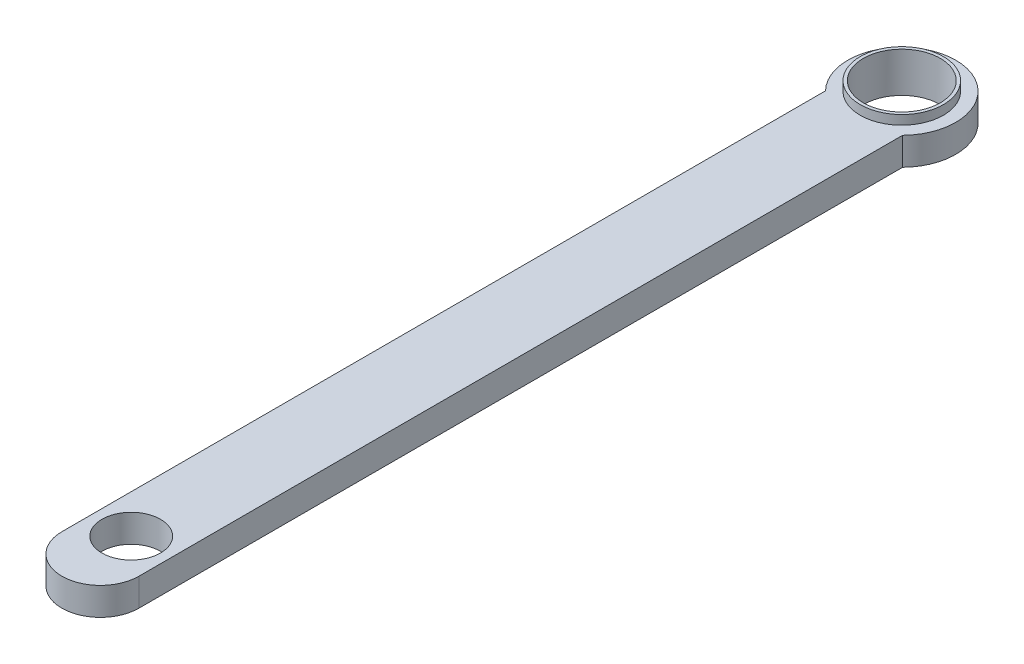
ISO-10303-21;
HEADER;
FILE_DESCRIPTION(('STEP AP214'),'2;1');
FILE_NAME('part.step','',(''),(''),'','','');
FILE_SCHEMA(('AUTOMOTIVE_DESIGN { 1 0 10303 214 1 1 1 1 }'));
ENDSEC;
DATA;
#1=APPLICATION_CONTEXT('core data for automotive mechanical design processes');
#2=APPLICATION_PROTOCOL_DEFINITION('international standard','automotive_design',2000,#1);
#3=PRODUCT_CONTEXT('',#1,'mechanical');
#4=PRODUCT('Part','Part','',(#3));
#5=PRODUCT_RELATED_PRODUCT_CATEGORY('part','',(#4));
#6=PRODUCT_DEFINITION_FORMATION('','',#4);
#7=PRODUCT_DEFINITION_CONTEXT('part definition',#1,'design');
#8=PRODUCT_DEFINITION('design','',#6,#7);
#9=PRODUCT_DEFINITION_SHAPE('','',#8);
#10=(LENGTH_UNIT() NAMED_UNIT(*) SI_UNIT(.MILLI.,.METRE.));
#11=(NAMED_UNIT(*) PLANE_ANGLE_UNIT() SI_UNIT($,.RADIAN.));
#12=(NAMED_UNIT(*) SI_UNIT($,.STERADIAN.) SOLID_ANGLE_UNIT());
#13=UNCERTAINTY_MEASURE_WITH_UNIT(LENGTH_MEASURE(1.E-05),#10,'distance_accuracy_value','');
#14=(GEOMETRIC_REPRESENTATION_CONTEXT(3) GLOBAL_UNCERTAINTY_ASSIGNED_CONTEXT((#13)) GLOBAL_UNIT_ASSIGNED_CONTEXT((#10,
#11,#12)) REPRESENTATION_CONTEXT('',''));
#15=CARTESIAN_POINT('',(0.,0.,0.));
#16=DIRECTION('',(0.,0.,1.));
#17=DIRECTION('',(1.,0.,0.));
#18=AXIS2_PLACEMENT_3D('',#15,#16,#17);
#19=CARTESIAN_POINT('',(0.,0.,0.));
#20=DIRECTION('',(0.,1.,0.));
#21=DIRECTION('',(0.,0.,1.));
#22=AXIS2_PLACEMENT_3D('',#19,#20,#21);
#23=PLANE('',#22);
#24=CARTESIAN_POINT('',(0.,0.,250.));
#25=DIRECTION('',(0.,1.,0.));
#26=DIRECTION('',(0.,0.,1.));
#27=AXIS2_PLACEMENT_3D('',#24,#25,#26);
#28=CIRCLE('',#27,9.50000000000001);
#29=CARTESIAN_POINT('',(0.,0.,259.5));
#30=VERTEX_POINT('',#29);
#31=EDGE_CURVE('E236',#30,#30,#28,.T.);
#32=ORIENTED_EDGE('',*,*,#31,.T.);
#33=EDGE_LOOP('',(#32));
#34=FACE_BOUND('',#33,.T.);
#35=CARTESIAN_POINT('',(0.,0.,0.));
#36=DIRECTION('',(0.,1.,0.));
#37=DIRECTION('',(0.,0.,1.));
#38=AXIS2_PLACEMENT_3D('',#35,#36,#37);
#39=CIRCLE('',#38,17.5);
#40=CARTESIAN_POINT('',(12.5,0.,12.2474487139159));
#41=VERTEX_POINT('',#40);
#42=CARTESIAN_POINT('',(-12.5,0.,12.2474487139159));
#43=VERTEX_POINT('',#42);
#44=EDGE_CURVE('E103',#41,#43,#39,.T.);
#45=ORIENTED_EDGE('',*,*,#44,.F.);
#46=DIRECTION('',(0.,0.,-1.));
#47=VECTOR('',#46,1.);
#48=CARTESIAN_POINT('',(12.5,0.,260.));
#49=LINE('',#48,#47);
#50=CARTESIAN_POINT('',(12.5,0.,260.));
#51=VERTEX_POINT('',#50);
#52=EDGE_CURVE('E75',#51,#41,#49,.T.);
#53=ORIENTED_EDGE('',*,*,#52,.F.);
#54=CARTESIAN_POINT('',(0.,0.,260.));
#55=DIRECTION('',(0.,1.,0.));
#56=DIRECTION('',(0.,0.,1.));
#57=AXIS2_PLACEMENT_3D('',#54,#55,#56);
#58=CIRCLE('',#57,12.5);
#59=CARTESIAN_POINT('',(-12.4999999999999,0.,260.));
#60=VERTEX_POINT('',#59);
#61=EDGE_CURVE('E69',#60,#51,#58,.T.);
#62=ORIENTED_EDGE('',*,*,#61,.F.);
#63=DIRECTION('',(0.,0.,1.));
#64=VECTOR('',#63,1.);
#65=CARTESIAN_POINT('',(-12.5,0.,260.));
#66=LINE('',#65,#64);
#67=EDGE_CURVE('E94',#43,#60,#66,.T.);
#68=ORIENTED_EDGE('',*,*,#67,.F.);
#69=EDGE_LOOP('',(#45,#53,#62,#68));
#70=FACE_BOUND('',#69,.T.);
#71=CARTESIAN_POINT('',(0.,0.,0.));
#72=DIRECTION('',(0.,1.,0.));
#73=DIRECTION('',(0.,0.,1.));
#74=AXIS2_PLACEMENT_3D('',#71,#72,#73);
#75=CIRCLE('',#74,13.5);
#76=CARTESIAN_POINT('',(0.,0.,13.5));
#77=VERTEX_POINT('',#76);
#78=EDGE_CURVE('E11',#77,#77,#75,.F.);
#79=ORIENTED_EDGE('',*,*,#78,.F.);
#80=EDGE_LOOP('',(#79));
#81=FACE_BOUND('',#80,.T.);
#82=ADVANCED_FACE('F35',(#34,#70,#81),#23,.F.);
#83=CARTESIAN_POINT('',(0.,9.,0.));
#84=DIRECTION('',(0.,1.,0.));
#85=DIRECTION('',(0.,0.,1.));
#86=AXIS2_PLACEMENT_3D('',#83,#84,#85);
#87=PLANE('',#86);
#88=CARTESIAN_POINT('',(0.,9.,250.));
#89=DIRECTION('',(0.,1.,0.));
#90=DIRECTION('',(0.,0.,1.));
#91=AXIS2_PLACEMENT_3D('',#88,#89,#90);
#92=CIRCLE('',#91,9.50000000000001);
#93=CARTESIAN_POINT('',(0.,9.,259.5));
#94=VERTEX_POINT('',#93);
#95=EDGE_CURVE('E235',#94,#94,#92,.T.);
#96=ORIENTED_EDGE('',*,*,#95,.F.);
#97=EDGE_LOOP('',(#96));
#98=FACE_BOUND('',#97,.T.);
#99=CARTESIAN_POINT('',(0.,9.,0.));
#100=DIRECTION('',(0.,1.,0.));
#101=DIRECTION('',(0.,0.,1.));
#102=AXIS2_PLACEMENT_3D('',#99,#100,#101);
#103=CIRCLE('',#102,17.5);
#104=CARTESIAN_POINT('',(12.5,9.,12.2474487139159));
#105=VERTEX_POINT('',#104);
#106=CARTESIAN_POINT('',(-12.5,9.,12.2474487139159));
#107=VERTEX_POINT('',#106);
#108=EDGE_CURVE('E89',#105,#107,#103,.T.);
#109=ORIENTED_EDGE('',*,*,#108,.T.);
#110=DIRECTION('',(0.,0.,1.));
#111=VECTOR('',#110,1.);
#112=CARTESIAN_POINT('',(-12.5,9.,260.));
#113=LINE('',#112,#111);
#114=CARTESIAN_POINT('',(-12.4999999999999,9.,260.));
#115=VERTEX_POINT('',#114);
#116=EDGE_CURVE('E83',#107,#115,#113,.T.);
#117=ORIENTED_EDGE('',*,*,#116,.T.);
#118=CARTESIAN_POINT('',(0.,9.,260.));
#119=DIRECTION('',(0.,1.,0.));
#120=DIRECTION('',(0.,0.,1.));
#121=AXIS2_PLACEMENT_3D('',#118,#119,#120);
#122=CIRCLE('',#121,12.5);
#123=CARTESIAN_POINT('',(12.5,9.,260.));
#124=VERTEX_POINT('',#123);
#125=EDGE_CURVE('E87',#115,#124,#122,.T.);
#126=ORIENTED_EDGE('',*,*,#125,.T.);
#127=DIRECTION('',(0.,0.,-1.));
#128=VECTOR('',#127,1.);
#129=CARTESIAN_POINT('',(12.5,9.,260.));
#130=LINE('',#129,#128);
#131=EDGE_CURVE('E52',#124,#105,#130,.T.);
#132=ORIENTED_EDGE('',*,*,#131,.T.);
#133=EDGE_LOOP('',(#109,#117,#126,#132));
#134=FACE_BOUND('',#133,.T.);
#135=CARTESIAN_POINT('',(0.,9.,0.));
#136=DIRECTION('',(0.,1.,0.));
#137=DIRECTION('',(0.,0.,1.));
#138=AXIS2_PLACEMENT_3D('',#135,#136,#137);
#139=CIRCLE('',#138,13.5);
#140=CARTESIAN_POINT('',(0.,9.,13.5));
#141=VERTEX_POINT('',#140);
#142=EDGE_CURVE('E250',#141,#141,#139,.T.);
#143=ORIENTED_EDGE('',*,*,#142,.F.);
#144=EDGE_LOOP('',(#143));
#145=FACE_BOUND('',#144,.T.);
#146=ADVANCED_FACE('F84',(#98,#134,#145),#87,.T.);
#147=CARTESIAN_POINT('',(0.,9.,0.));
#148=DIRECTION('',(0.,-1.,0.));
#149=DIRECTION('',(0.,0.,-1.));
#150=AXIS2_PLACEMENT_3D('',#147,#148,#149);
#151=CYLINDRICAL_SURFACE('',#150,17.5);
#152=ORIENTED_EDGE('',*,*,#44,.T.);
#153=DIRECTION('',(0.,-1.,0.));
#154=VECTOR('',#153,1.);
#155=CARTESIAN_POINT('',(-12.5,9.,12.2474487139159));
#156=LINE('',#155,#154);
#157=EDGE_CURVE('E44',#107,#43,#156,.T.);
#158=ORIENTED_EDGE('',*,*,#157,.F.);
#159=ORIENTED_EDGE('',*,*,#108,.F.);
#160=DIRECTION('',(0.,-1.,0.));
#161=VECTOR('',#160,1.);
#162=CARTESIAN_POINT('',(12.5,9.,12.2474487139159));
#163=LINE('',#162,#161);
#164=EDGE_CURVE('E99',#105,#41,#163,.T.);
#165=ORIENTED_EDGE('',*,*,#164,.T.);
#166=EDGE_LOOP('',(#152,#158,#159,#165));
#167=FACE_BOUND('',#166,.T.);
#168=ADVANCED_FACE('F37',(#167),#151,.T.);
#169=CARTESIAN_POINT('',(-12.5,9.,260.));
#170=DIRECTION('',(1.,0.,0.));
#171=DIRECTION('',(0.,0.,-1.));
#172=AXIS2_PLACEMENT_3D('',#169,#170,#171);
#173=PLANE('',#172);
#174=ORIENTED_EDGE('',*,*,#67,.T.);
#175=DIRECTION('',(0.,-1.,0.));
#176=VECTOR('',#175,1.);
#177=CARTESIAN_POINT('',(-12.4999999999999,9.,260.));
#178=LINE('',#177,#176);
#179=EDGE_CURVE('E92',#115,#60,#178,.T.);
#180=ORIENTED_EDGE('',*,*,#179,.F.);
#181=ORIENTED_EDGE('',*,*,#116,.F.);
#182=ORIENTED_EDGE('',*,*,#157,.T.);
#183=EDGE_LOOP('',(#174,#180,#181,#182));
#184=FACE_BOUND('',#183,.T.);
#185=ADVANCED_FACE('F93',(#184),#173,.F.);
#186=CARTESIAN_POINT('',(0.,9.,260.));
#187=DIRECTION('',(0.,-1.,0.));
#188=DIRECTION('',(0.,0.,-1.));
#189=AXIS2_PLACEMENT_3D('',#186,#187,#188);
#190=CYLINDRICAL_SURFACE('',#189,12.5);
#191=ORIENTED_EDGE('',*,*,#61,.T.);
#192=DIRECTION('',(0.,-1.,0.));
#193=VECTOR('',#192,1.);
#194=CARTESIAN_POINT('',(12.5,9.,260.));
#195=LINE('',#194,#193);
#196=EDGE_CURVE('E95',#124,#51,#195,.T.);
#197=ORIENTED_EDGE('',*,*,#196,.F.);
#198=ORIENTED_EDGE('',*,*,#125,.F.);
#199=ORIENTED_EDGE('',*,*,#179,.T.);
#200=EDGE_LOOP('',(#191,#197,#198,#199));
#201=FACE_BOUND('',#200,.T.);
#202=ADVANCED_FACE('F97',(#201),#190,.T.);
#203=CARTESIAN_POINT('',(12.5,9.,260.));
#204=DIRECTION('',(-1.,0.,0.));
#205=DIRECTION('',(0.,0.,1.));
#206=AXIS2_PLACEMENT_3D('',#203,#204,#205);
#207=PLANE('',#206);
#208=ORIENTED_EDGE('',*,*,#52,.T.);
#209=ORIENTED_EDGE('',*,*,#164,.F.);
#210=ORIENTED_EDGE('',*,*,#131,.F.);
#211=ORIENTED_EDGE('',*,*,#196,.T.);
#212=EDGE_LOOP('',(#208,#209,#210,#211));
#213=FACE_BOUND('',#212,.T.);
#214=ADVANCED_FACE('F147',(#213),#207,.F.);
#215=CARTESIAN_POINT('',(0.,0.,0.));
#216=DIRECTION('',(0.,1.,0.));
#217=DIRECTION('',(0.,0.,1.));
#218=AXIS2_PLACEMENT_3D('',#215,#216,#217);
#219=CYLINDRICAL_SURFACE('',#218,12.5);
#220=CARTESIAN_POINT('',(0.,12.,0.));
#221=DIRECTION('',(0.,1.,0.));
#222=DIRECTION('',(0.,0.,1.));
#223=AXIS2_PLACEMENT_3D('',#220,#221,#222);
#224=CIRCLE('',#223,12.5);
#225=CARTESIAN_POINT('',(0.,12.,12.5));
#226=VERTEX_POINT('',#225);
#227=EDGE_CURVE('E247',#226,#226,#224,.T.);
#228=ORIENTED_EDGE('',*,*,#227,.T.);
#229=EDGE_LOOP('',(#228));
#230=FACE_BOUND('',#229,.T.);
#231=CARTESIAN_POINT('',(0.,-1.,0.));
#232=DIRECTION('',(0.,-1.,0.));
#233=DIRECTION('',(0.,0.,-1.));
#234=AXIS2_PLACEMENT_3D('',#231,#232,#233);
#235=CIRCLE('',#234,12.5);
#236=CARTESIAN_POINT('',(0.,-1.,-12.5));
#237=VERTEX_POINT('',#236);
#238=EDGE_CURVE('E239',#237,#237,#235,.T.);
#239=ORIENTED_EDGE('',*,*,#238,.T.);
#240=EDGE_LOOP('',(#239));
#241=FACE_BOUND('',#240,.T.);
#242=ADVANCED_FACE('F140',(#230,#241),#219,.F.);
#243=CARTESIAN_POINT('',(0.,12.,0.));
#244=DIRECTION('',(0.,1.,0.));
#245=DIRECTION('',(0.,0.,1.));
#246=AXIS2_PLACEMENT_3D('',#243,#244,#245);
#247=PLANE('',#246);
#248=CARTESIAN_POINT('',(0.,12.,0.));
#249=DIRECTION('',(0.,1.,0.));
#250=DIRECTION('',(0.,0.,1.));
#251=AXIS2_PLACEMENT_3D('',#248,#249,#250);
#252=CIRCLE('',#251,13.5);
#253=CARTESIAN_POINT('',(0.,12.,13.5));
#254=VERTEX_POINT('',#253);
#255=EDGE_CURVE('E106',#254,#254,#252,.T.);
#256=ORIENTED_EDGE('',*,*,#255,.T.);
#257=EDGE_LOOP('',(#256));
#258=FACE_BOUND('',#257,.T.);
#259=ORIENTED_EDGE('',*,*,#227,.F.);
#260=EDGE_LOOP('',(#259));
#261=FACE_BOUND('',#260,.T.);
#262=ADVANCED_FACE('F137',(#258,#261),#247,.T.);
#263=CARTESIAN_POINT('',(0.,12.,0.));
#264=DIRECTION('',(0.,-1.,0.));
#265=DIRECTION('',(0.,0.,-1.));
#266=AXIS2_PLACEMENT_3D('',#263,#264,#265);
#267=CYLINDRICAL_SURFACE('',#266,13.5);
#268=ORIENTED_EDGE('',*,*,#255,.F.);
#269=EDGE_LOOP('',(#268));
#270=FACE_BOUND('',#269,.T.);
#271=ORIENTED_EDGE('',*,*,#142,.T.);
#272=EDGE_LOOP('',(#271));
#273=FACE_BOUND('',#272,.T.);
#274=ADVANCED_FACE('F132',(#270,#273),#267,.T.);
#275=CARTESIAN_POINT('',(0.,-1.,0.));
#276=DIRECTION('',(0.,-1.,0.));
#277=DIRECTION('',(0.,0.,-1.));
#278=AXIS2_PLACEMENT_3D('',#275,#276,#277);
#279=PLANE('',#278);
#280=CARTESIAN_POINT('',(0.,-1.,0.));
#281=DIRECTION('',(0.,-1.,0.));
#282=DIRECTION('',(0.,0.,-1.));
#283=AXIS2_PLACEMENT_3D('',#280,#281,#282);
#284=CIRCLE('',#283,13.5);
#285=CARTESIAN_POINT('',(0.,-1.,-13.5));
#286=VERTEX_POINT('',#285);
#287=EDGE_CURVE('E244',#286,#286,#284,.T.);
#288=ORIENTED_EDGE('',*,*,#287,.T.);
#289=EDGE_LOOP('',(#288));
#290=FACE_BOUND('',#289,.T.);
#291=ORIENTED_EDGE('',*,*,#238,.F.);
#292=EDGE_LOOP('',(#291));
#293=FACE_BOUND('',#292,.T.);
#294=ADVANCED_FACE('F123',(#290,#293),#279,.T.);
#295=CARTESIAN_POINT('',(0.,-1.,0.));
#296=DIRECTION('',(0.,1.,0.));
#297=DIRECTION('',(0.,0.,1.));
#298=AXIS2_PLACEMENT_3D('',#295,#296,#297);
#299=CYLINDRICAL_SURFACE('',#298,13.5);
#300=ORIENTED_EDGE('',*,*,#287,.F.);
#301=EDGE_LOOP('',(#300));
#302=FACE_BOUND('',#301,.T.);
#303=ORIENTED_EDGE('',*,*,#78,.T.);
#304=EDGE_LOOP('',(#303));
#305=FACE_BOUND('',#304,.T.);
#306=ADVANCED_FACE('F120',(#302,#305),#299,.T.);
#307=CARTESIAN_POINT('',(0.,-0.999999999999999,250.));
#308=DIRECTION('',(0.,1.,0.));
#309=DIRECTION('',(0.,0.,1.));
#310=AXIS2_PLACEMENT_3D('',#307,#308,#309);
#311=CYLINDRICAL_SURFACE('',#310,9.50000000000001);
#312=ORIENTED_EDGE('',*,*,#95,.T.);
#313=EDGE_LOOP('',(#312));
#314=FACE_BOUND('',#313,.T.);
#315=ORIENTED_EDGE('',*,*,#31,.F.);
#316=EDGE_LOOP('',(#315));
#317=FACE_BOUND('',#316,.T.);
#318=ADVANCED_FACE('F122',(#314,#317),#311,.F.);
#319=CLOSED_SHELL('',(#82,#146,#168,#185,#202,#214,#242,#262,#274,#294,#306,#318));
#320=MANIFOLD_SOLID_BREP('B2',#319);
#321=ADVANCED_BREP_SHAPE_REPRESENTATION('',(#18,#320),#14);
#322=SHAPE_DEFINITION_REPRESENTATION(#9,#321);
ENDSEC;
END-ISO-10303-21;
